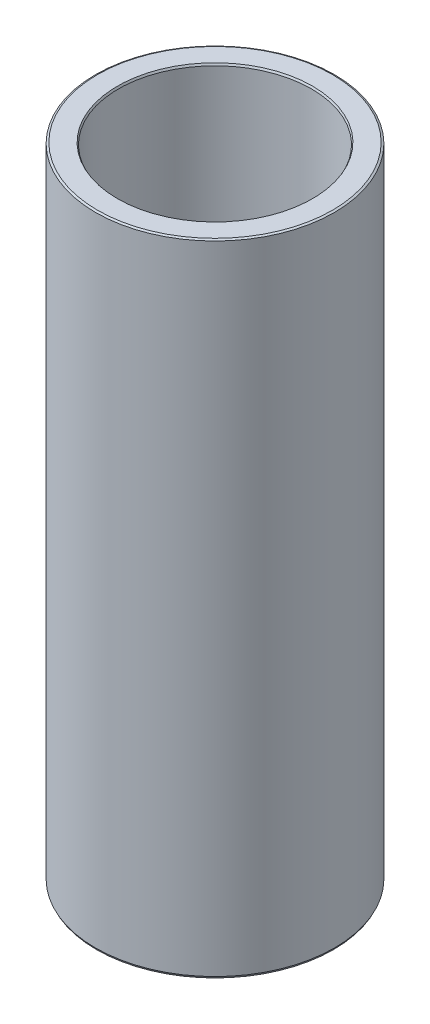
ISO-10303-21;
HEADER;
FILE_DESCRIPTION(('STEP AP214'),'2;1');
FILE_NAME('part.step','',(''),(''),'','','');
FILE_SCHEMA(('AUTOMOTIVE_DESIGN { 1 0 10303 214 1 1 1 1 }'));
ENDSEC;
DATA;
#1=APPLICATION_CONTEXT('core data for automotive mechanical design processes');
#2=APPLICATION_PROTOCOL_DEFINITION('international standard','automotive_design',2000,#1);
#3=PRODUCT_CONTEXT('',#1,'mechanical');
#4=PRODUCT('Part','Part','',(#3));
#5=PRODUCT_RELATED_PRODUCT_CATEGORY('part','',(#4));
#6=PRODUCT_DEFINITION_FORMATION('','',#4);
#7=PRODUCT_DEFINITION_CONTEXT('part definition',#1,'design');
#8=PRODUCT_DEFINITION('design','',#6,#7);
#9=PRODUCT_DEFINITION_SHAPE('','',#8);
#10=(LENGTH_UNIT() NAMED_UNIT(*) SI_UNIT(.MILLI.,.METRE.));
#11=(NAMED_UNIT(*) PLANE_ANGLE_UNIT() SI_UNIT($,.RADIAN.));
#12=(NAMED_UNIT(*) SI_UNIT($,.STERADIAN.) SOLID_ANGLE_UNIT());
#13=UNCERTAINTY_MEASURE_WITH_UNIT(LENGTH_MEASURE(1.E-05),#10,'distance_accuracy_value','');
#14=(GEOMETRIC_REPRESENTATION_CONTEXT(3) GLOBAL_UNCERTAINTY_ASSIGNED_CONTEXT((#13)) GLOBAL_UNIT_ASSIGNED_CONTEXT((#10,
#11,#12)) REPRESENTATION_CONTEXT('',''));
#15=CARTESIAN_POINT('',(0.,0.,0.));
#16=DIRECTION('',(0.,0.,1.));
#17=DIRECTION('',(1.,0.,0.));
#18=AXIS2_PLACEMENT_3D('',#15,#16,#17);
#19=CARTESIAN_POINT('',(0.,160.737644981627,0.));
#20=DIRECTION('',(0.,-1.,0.));
#21=DIRECTION('',(0.,0.,-1.));
#22=AXIS2_PLACEMENT_3D('',#19,#20,#21);
#23=CYLINDRICAL_SURFACE('',#22,30.);
#24=CARTESIAN_POINT('',(0.,0.483999982461569,0.));
#25=DIRECTION('',(0.,1.,0.));
#26=DIRECTION('',(0.,0.,1.));
#27=AXIS2_PLACEMENT_3D('',#24,#25,#26);
#28=CIRCLE('',#27,30.);
#29=CARTESIAN_POINT('',(0.,0.483999982461569,30.));
#30=VERTEX_POINT('',#29);
#31=EDGE_CURVE('E10',#30,#30,#28,.T.);
#32=ORIENTED_EDGE('',*,*,#31,.T.);
#33=EDGE_LOOP('',(#32));
#34=FACE_BOUND('',#33,.T.);
#35=CARTESIAN_POINT('',(0.,160.492746832733,0.));
#36=DIRECTION('',(0.,1.,0.));
#37=DIRECTION('',(0.,0.,1.));
#38=AXIS2_PLACEMENT_3D('',#35,#36,#37);
#39=CIRCLE('',#38,30.);
#40=CARTESIAN_POINT('',(0.,160.492746832733,30.));
#41=VERTEX_POINT('',#40);
#42=EDGE_CURVE('E50',#41,#41,#39,.F.);
#43=ORIENTED_EDGE('',*,*,#42,.T.);
#44=EDGE_LOOP('',(#43));
#45=FACE_BOUND('',#44,.T.);
#46=ADVANCED_FACE('F39',(#34,#45),#23,.T.);
#47=CARTESIAN_POINT('',(0.,160.737644981627,0.));
#48=DIRECTION('',(0.,1.,0.));
#49=DIRECTION('',(0.,0.,1.));
#50=AXIS2_PLACEMENT_3D('',#47,#48,#49);
#51=PLANE('',#50);
#52=CARTESIAN_POINT('',(0.,160.737644981627,0.));
#53=DIRECTION('',(0.,1.,0.));
#54=DIRECTION('',(0.,0.,1.));
#55=AXIS2_PLACEMENT_3D('',#52,#53,#54);
#56=CIRCLE('',#55,24.5005632584578);
#57=CARTESIAN_POINT('',(0.,160.737644981627,24.5005632584578));
#58=VERTEX_POINT('',#57);
#59=EDGE_CURVE('E58',#58,#58,#56,.F.);
#60=ORIENTED_EDGE('',*,*,#59,.T.);
#61=EDGE_LOOP('',(#60));
#62=FACE_BOUND('',#61,.T.);
#63=CARTESIAN_POINT('',(0.,160.737644981627,0.));
#64=DIRECTION('',(0.,1.,0.));
#65=DIRECTION('',(0.,0.,1.));
#66=AXIS2_PLACEMENT_3D('',#63,#64,#65);
#67=CIRCLE('',#66,29.5160000175386);
#68=CARTESIAN_POINT('',(0.,160.737644981627,29.5160000175386));
#69=VERTEX_POINT('',#68);
#70=EDGE_CURVE('E61',#69,#69,#67,.T.);
#71=ORIENTED_EDGE('',*,*,#70,.T.);
#72=EDGE_LOOP('',(#71));
#73=FACE_BOUND('',#72,.T.);
#74=ADVANCED_FACE('F88',(#62,#73),#51,.T.);
#75=CARTESIAN_POINT('',(0.,0.,0.));
#76=DIRECTION('',(0.,1.,0.));
#77=DIRECTION('',(0.,0.,1.));
#78=AXIS2_PLACEMENT_3D('',#75,#76,#77);
#79=PLANE('',#78);
#80=CARTESIAN_POINT('',(0.,0.,0.));
#81=DIRECTION('',(0.,1.,0.));
#82=DIRECTION('',(0.,0.,1.));
#83=AXIS2_PLACEMENT_3D('',#80,#81,#82);
#84=CIRCLE('',#83,24.7396650920257);
#85=CARTESIAN_POINT('',(0.,0.,24.7396650920257));
#86=VERTEX_POINT('',#85);
#87=EDGE_CURVE('E51',#86,#86,#84,.T.);
#88=ORIENTED_EDGE('',*,*,#87,.T.);
#89=EDGE_LOOP('',(#88));
#90=FACE_BOUND('',#89,.T.);
#91=CARTESIAN_POINT('',(0.,0.,0.));
#92=DIRECTION('',(0.,1.,0.));
#93=DIRECTION('',(0.,0.,1.));
#94=AXIS2_PLACEMENT_3D('',#91,#92,#93);
#95=CIRCLE('',#94,29.7551018511064);
#96=CARTESIAN_POINT('',(0.,0.,29.7551018511064));
#97=VERTEX_POINT('',#96);
#98=EDGE_CURVE('E54',#97,#97,#95,.F.);
#99=ORIENTED_EDGE('',*,*,#98,.T.);
#100=EDGE_LOOP('',(#99));
#101=FACE_BOUND('',#100,.T.);
#102=ADVANCED_FACE('F83',(#90,#101),#79,.F.);
#103=CARTESIAN_POINT('',(0.,160.737644981627,0.));
#104=DIRECTION('',(0.,-1.,0.));
#105=DIRECTION('',(0.,0.,-1.));
#106=AXIS2_PLACEMENT_3D('',#103,#104,#105);
#107=CYLINDRICAL_SURFACE('',#106,24.2556651095642);
#108=CARTESIAN_POINT('',(0.,160.253644999165,0.));
#109=DIRECTION('',(0.,1.,0.));
#110=DIRECTION('',(0.,0.,1.));
#111=AXIS2_PLACEMENT_3D('',#108,#109,#110);
#112=CIRCLE('',#111,24.2556651095642);
#113=CARTESIAN_POINT('',(0.,160.253644999165,24.2556651095642));
#114=VERTEX_POINT('',#113);
#115=EDGE_CURVE('E67',#114,#114,#112,.T.);
#116=ORIENTED_EDGE('',*,*,#115,.T.);
#117=EDGE_LOOP('',(#116));
#118=FACE_BOUND('',#117,.T.);
#119=CARTESIAN_POINT('',(0.,0.244898148893585,0.));
#120=DIRECTION('',(0.,1.,0.));
#121=DIRECTION('',(0.,0.,1.));
#122=AXIS2_PLACEMENT_3D('',#119,#120,#121);
#123=CIRCLE('',#122,24.2556651095642);
#124=CARTESIAN_POINT('',(0.,0.244898148893585,24.2556651095642));
#125=VERTEX_POINT('',#124);
#126=EDGE_CURVE('E69',#125,#125,#123,.F.);
#127=ORIENTED_EDGE('',*,*,#126,.T.);
#128=EDGE_LOOP('',(#127));
#129=FACE_BOUND('',#128,.T.);
#130=ADVANCED_FACE('F71',(#118,#129),#107,.F.);
#131=CARTESIAN_POINT('',(0.,160.253644999165,0.));
#132=DIRECTION('',(0.,1.,0.));
#133=DIRECTION('',(0.,0.,1.));
#134=AXIS2_PLACEMENT_3D('',#131,#132,#133);
#135=CONICAL_SURFACE('',#134,24.2556651095642,0.46842646976013);
#136=ORIENTED_EDGE('',*,*,#59,.F.);
#137=EDGE_LOOP('',(#136));
#138=FACE_BOUND('',#137,.T.);
#139=ORIENTED_EDGE('',*,*,#115,.F.);
#140=EDGE_LOOP('',(#139));
#141=FACE_BOUND('',#140,.T.);
#142=ADVANCED_FACE('F77',(#138,#141),#135,.F.);
#143=CARTESIAN_POINT('',(0.,0.,0.));
#144=DIRECTION('',(0.,-1.,0.));
#145=DIRECTION('',(0.,0.,-1.));
#146=AXIS2_PLACEMENT_3D('',#143,#144,#145);
#147=CONICAL_SURFACE('',#146,24.7396650920257,1.10236985703478);
#148=ORIENTED_EDGE('',*,*,#126,.F.);
#149=EDGE_LOOP('',(#148));
#150=FACE_BOUND('',#149,.T.);
#151=ORIENTED_EDGE('',*,*,#87,.F.);
#152=EDGE_LOOP('',(#151));
#153=FACE_BOUND('',#152,.T.);
#154=ADVANCED_FACE('F73',(#150,#153),#147,.F.);
#155=CARTESIAN_POINT('',(0.,0.483999982461569,0.));
#156=DIRECTION('',(0.,1.,0.));
#157=DIRECTION('',(0.,0.,1.));
#158=AXIS2_PLACEMENT_3D('',#155,#156,#157);
#159=CONICAL_SURFACE('',#158,30.,0.468426469760106);
#160=ORIENTED_EDGE('',*,*,#98,.F.);
#161=EDGE_LOOP('',(#160));
#162=FACE_BOUND('',#161,.T.);
#163=ORIENTED_EDGE('',*,*,#31,.F.);
#164=EDGE_LOOP('',(#163));
#165=FACE_BOUND('',#164,.T.);
#166=ADVANCED_FACE('F76',(#162,#165),#159,.T.);
#167=CARTESIAN_POINT('',(0.,160.737644981627,0.));
#168=DIRECTION('',(0.,-1.,0.));
#169=DIRECTION('',(0.,0.,-1.));
#170=AXIS2_PLACEMENT_3D('',#167,#168,#169);
#171=CONICAL_SURFACE('',#170,29.5160000175386,1.10236985703472);
#172=ORIENTED_EDGE('',*,*,#42,.F.);
#173=EDGE_LOOP('',(#172));
#174=FACE_BOUND('',#173,.T.);
#175=ORIENTED_EDGE('',*,*,#70,.F.);
#176=EDGE_LOOP('',(#175));
#177=FACE_BOUND('',#176,.T.);
#178=ADVANCED_FACE('F45',(#174,#177),#171,.T.);
#179=CLOSED_SHELL('',(#46,#74,#102,#130,#142,#154,#166,#178));
#180=MANIFOLD_SOLID_BREP('B2',#179);
#181=ADVANCED_BREP_SHAPE_REPRESENTATION('',(#18,#180),#14);
#182=SHAPE_DEFINITION_REPRESENTATION(#9,#181);
ENDSEC;
END-ISO-10303-21;
